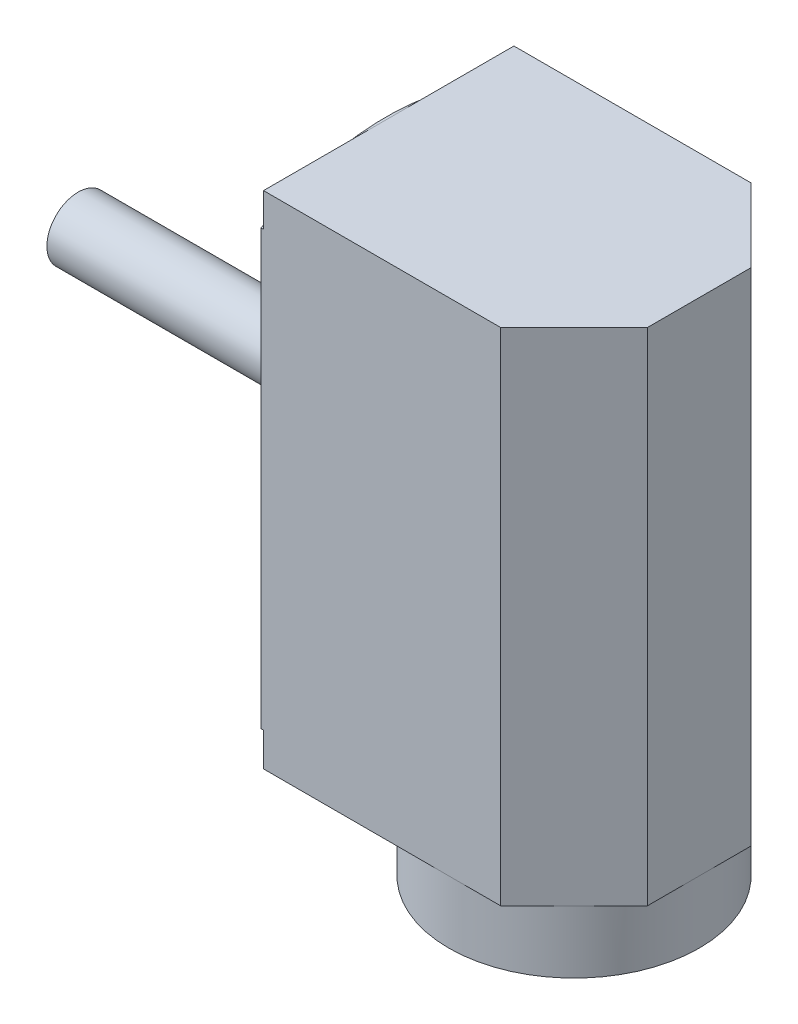
ISO-10303-21;
HEADER;
FILE_DESCRIPTION(('STEP AP214'),'2;1');
FILE_NAME('part.step','',(''),(''),'','','');
FILE_SCHEMA(('AUTOMOTIVE_DESIGN { 1 0 10303 214 1 1 1 1 }'));
ENDSEC;
DATA;
#1=APPLICATION_CONTEXT('core data for automotive mechanical design processes');
#2=APPLICATION_PROTOCOL_DEFINITION('international standard','automotive_design',2000,#1);
#3=PRODUCT_CONTEXT('',#1,'mechanical');
#4=PRODUCT('Part','Part','',(#3));
#5=PRODUCT_RELATED_PRODUCT_CATEGORY('part','',(#4));
#6=PRODUCT_DEFINITION_FORMATION('','',#4);
#7=PRODUCT_DEFINITION_CONTEXT('part definition',#1,'design');
#8=PRODUCT_DEFINITION('design','',#6,#7);
#9=PRODUCT_DEFINITION_SHAPE('','',#8);
#10=(LENGTH_UNIT() NAMED_UNIT(*) SI_UNIT(.MILLI.,.METRE.));
#11=(NAMED_UNIT(*) PLANE_ANGLE_UNIT() SI_UNIT($,.RADIAN.));
#12=(NAMED_UNIT(*) SI_UNIT($,.STERADIAN.) SOLID_ANGLE_UNIT());
#13=UNCERTAINTY_MEASURE_WITH_UNIT(LENGTH_MEASURE(1.E-05),#10,'distance_accuracy_value','');
#14=(GEOMETRIC_REPRESENTATION_CONTEXT(3) GLOBAL_UNCERTAINTY_ASSIGNED_CONTEXT((#13)) GLOBAL_UNIT_ASSIGNED_CONTEXT((#10,
#11,#12)) REPRESENTATION_CONTEXT('',''));
#15=CARTESIAN_POINT('',(0.,0.,0.));
#16=DIRECTION('',(0.,0.,1.));
#17=DIRECTION('',(1.,0.,0.));
#18=AXIS2_PLACEMENT_3D('',#15,#16,#17);
#19=CARTESIAN_POINT('',(0.,25.4,6.35));
#20=DIRECTION('',(1.,0.,0.));
#21=DIRECTION('',(0.,0.,-1.));
#22=AXIS2_PLACEMENT_3D('',#19,#20,#21);
#23=PLANE('',#22);
#24=CARTESIAN_POINT('',(0.,22.225,0.));
#25=DIRECTION('',(-1.,0.,0.));
#26=DIRECTION('',(0.,0.,1.));
#27=AXIS2_PLACEMENT_3D('',#24,#25,#26);
#28=CIRCLE('',#27,0.79375);
#29=CARTESIAN_POINT('',(0.,22.225,0.79375));
#30=VERTEX_POINT('',#29);
#31=EDGE_CURVE('E252',#30,#30,#28,.T.);
#32=ORIENTED_EDGE('',*,*,#31,.F.);
#33=EDGE_LOOP('',(#32));
#34=FACE_BOUND('',#33,.T.);
#35=CARTESIAN_POINT('',(0.,12.7,0.));
#36=DIRECTION('',(-1.,0.,0.));
#37=DIRECTION('',(0.,0.,1.));
#38=AXIS2_PLACEMENT_3D('',#35,#36,#37);
#39=CIRCLE('',#38,5.55625);
#40=CARTESIAN_POINT('',(0.,12.7,5.55625));
#41=VERTEX_POINT('',#40);
#42=EDGE_CURVE('E236',#41,#41,#39,.T.);
#43=ORIENTED_EDGE('',*,*,#42,.F.);
#44=EDGE_LOOP('',(#43));
#45=FACE_BOUND('',#44,.T.);
#46=DIRECTION('',(0.,-1.,0.));
#47=VECTOR('',#46,1.);
#48=CARTESIAN_POINT('',(0.,25.4,6.35));
#49=LINE('',#48,#47);
#50=CARTESIAN_POINT('',(0.,23.6985226280624,6.35));
#51=VERTEX_POINT('',#50);
#52=CARTESIAN_POINT('',(0.,1.70147737193763,6.35));
#53=VERTEX_POINT('',#52);
#54=EDGE_CURVE('E163',#51,#53,#49,.T.);
#55=ORIENTED_EDGE('',*,*,#54,.F.);
#56=CARTESIAN_POINT('',(0.,12.7,0.));
#57=DIRECTION('',(-1.,0.,0.));
#58=DIRECTION('',(0.,0.,1.));
#59=AXIS2_PLACEMENT_3D('',#56,#57,#58);
#60=CIRCLE('',#59,12.7);
#61=CARTESIAN_POINT('',(0.,23.6985226280624,-6.35));
#62=VERTEX_POINT('',#61);
#63=EDGE_CURVE('E145',#51,#62,#60,.T.);
#64=ORIENTED_EDGE('',*,*,#63,.T.);
#65=DIRECTION('',(0.,-1.,0.));
#66=VECTOR('',#65,1.);
#67=CARTESIAN_POINT('',(0.,25.4,-6.35));
#68=LINE('',#67,#66);
#69=CARTESIAN_POINT('',(0.,1.70147737193763,-6.35));
#70=VERTEX_POINT('',#69);
#71=EDGE_CURVE('E173',#62,#70,#68,.T.);
#72=ORIENTED_EDGE('',*,*,#71,.T.);
#73=CARTESIAN_POINT('',(0.,12.7,0.));
#74=DIRECTION('',(-1.,0.,0.));
#75=DIRECTION('',(0.,0.,1.));
#76=AXIS2_PLACEMENT_3D('',#73,#74,#75);
#77=CIRCLE('',#76,12.7);
#78=EDGE_CURVE('E170',#70,#53,#77,.T.);
#79=ORIENTED_EDGE('',*,*,#78,.T.);
#80=EDGE_LOOP('',(#55,#64,#72,#79));
#81=FACE_BOUND('',#80,.T.);
#82=ADVANCED_FACE('F43',(#34,#45,#81),#23,.F.);
#83=CARTESIAN_POINT('',(12.1552561210692,25.4,6.35));
#84=DIRECTION('',(0.,0.,-1.));
#85=DIRECTION('',(-1.,0.,0.));
#86=AXIS2_PLACEMENT_3D('',#83,#84,#85);
#87=PLANE('',#86);
#88=DIRECTION('',(-1.,0.,0.));
#89=VECTOR('',#88,1.);
#90=CARTESIAN_POINT('',(0.127000000000001,23.6985226280624,6.35));
#91=LINE('',#90,#89);
#92=CARTESIAN_POINT('',(0.127000000000001,23.6985226280624,6.35));
#93=VERTEX_POINT('',#92);
#94=EDGE_CURVE('E148',#93,#51,#91,.T.);
#95=ORIENTED_EDGE('',*,*,#94,.T.);
#96=ORIENTED_EDGE('',*,*,#54,.T.);
#97=DIRECTION('',(-1.,0.,0.));
#98=VECTOR('',#97,1.);
#99=CARTESIAN_POINT('',(0.127000000000001,1.70147737193763,6.35));
#100=LINE('',#99,#98);
#101=CARTESIAN_POINT('',(0.127000000000001,1.70147737193763,6.35));
#102=VERTEX_POINT('',#101);
#103=EDGE_CURVE('E293',#102,#53,#100,.T.);
#104=ORIENTED_EDGE('',*,*,#103,.F.);
#105=DIRECTION('',(0.,1.,0.));
#106=VECTOR('',#105,1.);
#107=CARTESIAN_POINT('',(0.127000000000001,0.,6.35));
#108=LINE('',#107,#106);
#109=CARTESIAN_POINT('',(0.127000000000001,0.,6.35));
#110=VERTEX_POINT('',#109);
#111=EDGE_CURVE('E289',#110,#102,#108,.T.);
#112=ORIENTED_EDGE('',*,*,#111,.F.);
#113=DIRECTION('',(1.,0.,0.));
#114=VECTOR('',#113,1.);
#115=CARTESIAN_POINT('',(12.1552561210692,0.,6.35));
#116=LINE('',#115,#114);
#117=CARTESIAN_POINT('',(9.525,0.,6.35));
#118=VERTEX_POINT('',#117);
#119=EDGE_CURVE('E346',#110,#118,#116,.T.);
#120=ORIENTED_EDGE('',*,*,#119,.T.);
#121=CARTESIAN_POINT('',(12.1552561210692,0.,6.35));
#122=VERTEX_POINT('',#121);
#123=EDGE_CURVE('E225',#118,#122,#116,.T.);
#124=ORIENTED_EDGE('',*,*,#123,.T.);
#125=DIRECTION('',(0.,-1.,0.));
#126=VECTOR('',#125,1.);
#127=CARTESIAN_POINT('',(12.1552561210692,25.4,6.35));
#128=LINE('',#127,#126);
#129=CARTESIAN_POINT('',(12.1552561210692,25.4,6.35));
#130=VERTEX_POINT('',#129);
#131=EDGE_CURVE('E47',#130,#122,#128,.T.);
#132=ORIENTED_EDGE('',*,*,#131,.F.);
#133=DIRECTION('',(1.,0.,0.));
#134=VECTOR('',#133,1.);
#135=CARTESIAN_POINT('',(12.1552561210692,25.4,6.35));
#136=LINE('',#135,#134);
#137=CARTESIAN_POINT('',(0.127000000000001,25.4,6.35));
#138=VERTEX_POINT('',#137);
#139=EDGE_CURVE('E331',#138,#130,#136,.T.);
#140=ORIENTED_EDGE('',*,*,#139,.F.);
#141=DIRECTION('',(0.,1.,0.));
#142=VECTOR('',#141,1.);
#143=CARTESIAN_POINT('',(0.127000000000001,0.,6.35));
#144=LINE('',#143,#142);
#145=EDGE_CURVE('E165',#93,#138,#144,.T.);
#146=ORIENTED_EDGE('',*,*,#145,.F.);
#147=EDGE_LOOP('',(#95,#96,#104,#112,#120,#124,#132,#140,#146));
#148=FACE_BOUND('',#147,.T.);
#149=ADVANCED_FACE('F45',(#148),#87,.F.);
#150=CARTESIAN_POINT('',(0.,25.4,0.));
#151=DIRECTION('',(0.,-1.,0.));
#152=DIRECTION('',(0.,0.,-1.));
#153=AXIS2_PLACEMENT_3D('',#150,#151,#152);
#154=PLANE('',#153);
#155=DIRECTION('',(0.,0.,-1.));
#156=VECTOR('',#155,1.);
#157=CARTESIAN_POINT('',(0.127,25.4,0.));
#158=LINE('',#157,#156);
#159=CARTESIAN_POINT('',(0.127,25.4,0.));
#160=VERTEX_POINT('',#159);
#161=EDGE_CURVE('E167',#138,#160,#158,.T.);
#162=ORIENTED_EDGE('',*,*,#161,.F.);
#163=ORIENTED_EDGE('',*,*,#139,.T.);
#164=DIRECTION('',(0.707106781186546,0.,-0.707106781186549));
#165=VECTOR('',#164,1.);
#166=CARTESIAN_POINT('',(15.875,25.4,2.63025612106914));
#167=LINE('',#166,#165);
#168=CARTESIAN_POINT('',(15.875,25.4,2.63025612106914));
#169=VERTEX_POINT('',#168);
#170=EDGE_CURVE('E354',#130,#169,#167,.T.);
#171=ORIENTED_EDGE('',*,*,#170,.T.);
#172=DIRECTION('',(0.,0.,-1.));
#173=VECTOR('',#172,1.);
#174=CARTESIAN_POINT('',(15.875,25.4,-2.63025612106914));
#175=LINE('',#174,#173);
#176=CARTESIAN_POINT('',(15.875,25.4,-2.63025612106914));
#177=VERTEX_POINT('',#176);
#178=EDGE_CURVE('E351',#169,#177,#175,.T.);
#179=ORIENTED_EDGE('',*,*,#178,.T.);
#180=DIRECTION('',(-0.707106781186545,0.,-0.70710678118655));
#181=VECTOR('',#180,1.);
#182=CARTESIAN_POINT('',(12.1552561210692,25.4,-6.35));
#183=LINE('',#182,#181);
#184=CARTESIAN_POINT('',(12.1552561210692,25.4,-6.35));
#185=VERTEX_POINT('',#184);
#186=EDGE_CURVE('E181',#177,#185,#183,.T.);
#187=ORIENTED_EDGE('',*,*,#186,.T.);
#188=DIRECTION('',(-1.,0.,0.));
#189=VECTOR('',#188,1.);
#190=CARTESIAN_POINT('',(0.,25.4,-6.35));
#191=LINE('',#190,#189);
#192=CARTESIAN_POINT('',(0.126999999999999,25.4,-6.35));
#193=VERTEX_POINT('',#192);
#194=EDGE_CURVE('E174',#185,#193,#191,.T.);
#195=ORIENTED_EDGE('',*,*,#194,.T.);
#196=DIRECTION('',(0.,0.,-1.));
#197=VECTOR('',#196,1.);
#198=CARTESIAN_POINT('',(0.127,25.4,0.));
#199=LINE('',#198,#197);
#200=EDGE_CURVE('E279',#160,#193,#199,.T.);
#201=ORIENTED_EDGE('',*,*,#200,.F.);
#202=EDGE_LOOP('',(#162,#163,#171,#179,#187,#195,#201));
#203=FACE_BOUND('',#202,.T.);
#204=ADVANCED_FACE('F310',(#203),#154,.F.);
#205=CARTESIAN_POINT('',(0.,0.,0.));
#206=DIRECTION('',(0.,-1.,0.));
#207=DIRECTION('',(0.,0.,-1.));
#208=AXIS2_PLACEMENT_3D('',#205,#206,#207);
#209=PLANE('',#208);
#210=ORIENTED_EDGE('',*,*,#119,.F.);
#211=DIRECTION('',(0.,0.,1.));
#212=VECTOR('',#211,1.);
#213=CARTESIAN_POINT('',(0.127,0.,0.));
#214=LINE('',#213,#212);
#215=CARTESIAN_POINT('',(0.127,0.,0.));
#216=VERTEX_POINT('',#215);
#217=EDGE_CURVE('E286',#216,#110,#214,.T.);
#218=ORIENTED_EDGE('',*,*,#217,.F.);
#219=DIRECTION('',(0.,0.,1.));
#220=VECTOR('',#219,1.);
#221=CARTESIAN_POINT('',(0.127,0.,0.));
#222=LINE('',#221,#220);
#223=CARTESIAN_POINT('',(0.126999999999999,0.,-6.35));
#224=VERTEX_POINT('',#223);
#225=EDGE_CURVE('E262',#224,#216,#222,.T.);
#226=ORIENTED_EDGE('',*,*,#225,.F.);
#227=DIRECTION('',(-1.,0.,0.));
#228=VECTOR('',#227,1.);
#229=CARTESIAN_POINT('',(0.,0.,-6.35));
#230=LINE('',#229,#228);
#231=CARTESIAN_POINT('',(9.525,0.,-6.35));
#232=VERTEX_POINT('',#231);
#233=EDGE_CURVE('E326',#232,#224,#230,.T.);
#234=ORIENTED_EDGE('',*,*,#233,.F.);
#235=CARTESIAN_POINT('',(9.525,0.,0.));
#236=DIRECTION('',(0.,-1.,0.));
#237=DIRECTION('',(0.,0.,-1.));
#238=AXIS2_PLACEMENT_3D('',#235,#236,#237);
#239=CIRCLE('',#238,6.35);
#240=EDGE_CURVE('E203',#118,#232,#239,.T.);
#241=ORIENTED_EDGE('',*,*,#240,.F.);
#242=EDGE_LOOP('',(#210,#218,#226,#234,#241));
#243=FACE_BOUND('',#242,.T.);
#244=ADVANCED_FACE('F325',(#243),#209,.T.);
#245=CARTESIAN_POINT('',(0.,25.4,-6.35));
#246=DIRECTION('',(0.,0.,1.));
#247=DIRECTION('',(1.,0.,0.));
#248=AXIS2_PLACEMENT_3D('',#245,#246,#247);
#249=PLANE('',#248);
#250=DIRECTION('',(-1.,0.,0.));
#251=VECTOR('',#250,1.);
#252=CARTESIAN_POINT('',(0.126999999999999,23.6985226280624,-6.35));
#253=LINE('',#252,#251);
#254=CARTESIAN_POINT('',(0.126999999999999,23.6985226280624,-6.35));
#255=VERTEX_POINT('',#254);
#256=EDGE_CURVE('E150',#255,#62,#253,.T.);
#257=ORIENTED_EDGE('',*,*,#256,.F.);
#258=DIRECTION('',(0.,-1.,0.));
#259=VECTOR('',#258,1.);
#260=CARTESIAN_POINT('',(0.126999999999999,0.,-6.35));
#261=LINE('',#260,#259);
#262=EDGE_CURVE('E274',#193,#255,#261,.T.);
#263=ORIENTED_EDGE('',*,*,#262,.F.);
#264=ORIENTED_EDGE('',*,*,#194,.F.);
#265=DIRECTION('',(0.,-1.,0.));
#266=VECTOR('',#265,1.);
#267=CARTESIAN_POINT('',(12.1552561210692,25.4,-6.35));
#268=LINE('',#267,#266);
#269=CARTESIAN_POINT('',(12.1552561210692,0.,-6.35));
#270=VERTEX_POINT('',#269);
#271=EDGE_CURVE('E178',#185,#270,#268,.T.);
#272=ORIENTED_EDGE('',*,*,#271,.T.);
#273=EDGE_CURVE('E184',#270,#232,#230,.T.);
#274=ORIENTED_EDGE('',*,*,#273,.T.);
#275=ORIENTED_EDGE('',*,*,#233,.T.);
#276=DIRECTION('',(0.,-1.,0.));
#277=VECTOR('',#276,1.);
#278=CARTESIAN_POINT('',(0.126999999999999,0.,-6.35));
#279=LINE('',#278,#277);
#280=CARTESIAN_POINT('',(0.126999999999999,1.70147737193763,-6.35));
#281=VERTEX_POINT('',#280);
#282=EDGE_CURVE('E70',#281,#224,#279,.T.);
#283=ORIENTED_EDGE('',*,*,#282,.F.);
#284=DIRECTION('',(-1.,0.,0.));
#285=VECTOR('',#284,1.);
#286=CARTESIAN_POINT('',(0.126999999999999,1.70147737193763,-6.35));
#287=LINE('',#286,#285);
#288=EDGE_CURVE('E157',#281,#70,#287,.T.);
#289=ORIENTED_EDGE('',*,*,#288,.T.);
#290=ORIENTED_EDGE('',*,*,#71,.F.);
#291=EDGE_LOOP('',(#257,#263,#264,#272,#274,#275,#283,#289,#290));
#292=FACE_BOUND('',#291,.T.);
#293=ADVANCED_FACE('F315',(#292),#249,.F.);
#294=CARTESIAN_POINT('',(14.0151280605346,0.,-4.49012806053456));
#295=VERTEX_POINT('',#294);
#296=EDGE_CURVE('E55',#232,#295,#239,.T.);
#297=ORIENTED_EDGE('',*,*,#296,.F.);
#298=ORIENTED_EDGE('',*,*,#273,.F.);
#299=DIRECTION('',(-0.707106781186545,0.,-0.70710678118655));
#300=VECTOR('',#299,1.);
#301=CARTESIAN_POINT('',(12.1552561210692,0.,-6.35));
#302=LINE('',#301,#300);
#303=EDGE_CURVE('E333',#295,#270,#302,.T.);
#304=ORIENTED_EDGE('',*,*,#303,.F.);
#305=EDGE_LOOP('',(#297,#298,#304));
#306=FACE_BOUND('',#305,.T.);
#307=ADVANCED_FACE('F398',(#306),#209,.T.);
#308=CARTESIAN_POINT('',(15.875,0.,0.));
#309=VERTEX_POINT('',#308);
#310=EDGE_CURVE('E12',#295,#309,#239,.T.);
#311=ORIENTED_EDGE('',*,*,#310,.F.);
#312=CARTESIAN_POINT('',(15.875,0.,-2.63025612106914));
#313=VERTEX_POINT('',#312);
#314=EDGE_CURVE('E328',#313,#295,#302,.T.);
#315=ORIENTED_EDGE('',*,*,#314,.F.);
#316=DIRECTION('',(0.,0.,-1.));
#317=VECTOR('',#316,1.);
#318=CARTESIAN_POINT('',(15.875,0.,-2.63025612106914));
#319=LINE('',#318,#317);
#320=EDGE_CURVE('E341',#309,#313,#319,.T.);
#321=ORIENTED_EDGE('',*,*,#320,.F.);
#322=EDGE_LOOP('',(#311,#315,#321));
#323=FACE_BOUND('',#322,.T.);
#324=ADVANCED_FACE('F372',(#323),#209,.T.);
#325=CARTESIAN_POINT('',(14.0151280605346,0.,4.49012806053457));
#326=VERTEX_POINT('',#325);
#327=EDGE_CURVE('E53',#309,#326,#239,.T.);
#328=ORIENTED_EDGE('',*,*,#327,.F.);
#329=CARTESIAN_POINT('',(15.875,0.,2.63025612106914));
#330=VERTEX_POINT('',#329);
#331=EDGE_CURVE('E337',#330,#309,#319,.T.);
#332=ORIENTED_EDGE('',*,*,#331,.F.);
#333=DIRECTION('',(0.707106781186546,0.,-0.707106781186549));
#334=VECTOR('',#333,1.);
#335=CARTESIAN_POINT('',(15.875,0.,2.63025612106914));
#336=LINE('',#335,#334);
#337=EDGE_CURVE('E345',#326,#330,#336,.T.);
#338=ORIENTED_EDGE('',*,*,#337,.F.);
#339=EDGE_LOOP('',(#328,#332,#338));
#340=FACE_BOUND('',#339,.T.);
#341=ADVANCED_FACE('F370',(#340),#209,.T.);
#342=EDGE_CURVE('E210',#326,#118,#239,.T.);
#343=ORIENTED_EDGE('',*,*,#342,.F.);
#344=EDGE_CURVE('E342',#122,#326,#336,.T.);
#345=ORIENTED_EDGE('',*,*,#344,.F.);
#346=ORIENTED_EDGE('',*,*,#123,.F.);
#347=EDGE_LOOP('',(#343,#345,#346));
#348=FACE_BOUND('',#347,.T.);
#349=ADVANCED_FACE('F363',(#348),#209,.T.);
#350=CARTESIAN_POINT('',(15.875,25.4,2.63025612106914));
#351=DIRECTION('',(-0.707106781186549,0.,-0.707106781186546));
#352=DIRECTION('',(-0.707106781186546,0.,0.707106781186549));
#353=AXIS2_PLACEMENT_3D('',#350,#351,#352);
#354=PLANE('',#353);
#355=ORIENTED_EDGE('',*,*,#344,.T.);
#356=ORIENTED_EDGE('',*,*,#337,.T.);
#357=DIRECTION('',(0.,-1.,0.));
#358=VECTOR('',#357,1.);
#359=CARTESIAN_POINT('',(15.875,25.4,2.63025612106914));
#360=LINE('',#359,#358);
#361=EDGE_CURVE('E193',#169,#330,#360,.T.);
#362=ORIENTED_EDGE('',*,*,#361,.F.);
#363=ORIENTED_EDGE('',*,*,#170,.F.);
#364=ORIENTED_EDGE('',*,*,#131,.T.);
#365=EDGE_LOOP('',(#355,#356,#362,#363,#364));
#366=FACE_BOUND('',#365,.T.);
#367=ADVANCED_FACE('F357',(#366),#354,.F.);
#368=CARTESIAN_POINT('',(15.875,25.4,-2.63025612106914));
#369=DIRECTION('',(-1.,0.,0.));
#370=DIRECTION('',(0.,0.,1.));
#371=AXIS2_PLACEMENT_3D('',#368,#369,#370);
#372=PLANE('',#371);
#373=ORIENTED_EDGE('',*,*,#331,.T.);
#374=ORIENTED_EDGE('',*,*,#320,.T.);
#375=DIRECTION('',(0.,-1.,0.));
#376=VECTOR('',#375,1.);
#377=CARTESIAN_POINT('',(15.875,25.4,-2.63025612106914));
#378=LINE('',#377,#376);
#379=EDGE_CURVE('E190',#177,#313,#378,.T.);
#380=ORIENTED_EDGE('',*,*,#379,.F.);
#381=ORIENTED_EDGE('',*,*,#178,.F.);
#382=ORIENTED_EDGE('',*,*,#361,.T.);
#383=EDGE_LOOP('',(#373,#374,#380,#381,#382));
#384=FACE_BOUND('',#383,.T.);
#385=ADVANCED_FACE('F376',(#384),#372,.F.);
#386=CARTESIAN_POINT('',(12.1552561210692,25.4,-6.35));
#387=DIRECTION('',(-0.70710678118655,0.,0.707106781186545));
#388=DIRECTION('',(0.707106781186545,0.,0.70710678118655));
#389=AXIS2_PLACEMENT_3D('',#386,#387,#388);
#390=PLANE('',#389);
#391=ORIENTED_EDGE('',*,*,#314,.T.);
#392=ORIENTED_EDGE('',*,*,#303,.T.);
#393=ORIENTED_EDGE('',*,*,#271,.F.);
#394=ORIENTED_EDGE('',*,*,#186,.F.);
#395=ORIENTED_EDGE('',*,*,#379,.T.);
#396=EDGE_LOOP('',(#391,#392,#393,#394,#395));
#397=FACE_BOUND('',#396,.T.);
#398=ADVANCED_FACE('F378',(#397),#390,.F.);
#399=CARTESIAN_POINT('',(9.525,-3.175,0.));
#400=DIRECTION('',(0.,-1.,0.));
#401=DIRECTION('',(0.,0.,-1.));
#402=AXIS2_PLACEMENT_3D('',#399,#400,#401);
#403=PLANE('',#402);
#404=CARTESIAN_POINT('',(9.525,-3.175,0.));
#405=DIRECTION('',(0.,-1.,0.));
#406=DIRECTION('',(0.,0.,-1.));
#407=AXIS2_PLACEMENT_3D('',#404,#405,#406);
#408=CIRCLE('',#407,6.35);
#409=CARTESIAN_POINT('',(9.525,-3.175,-6.35));
#410=VERTEX_POINT('',#409);
#411=EDGE_CURVE('E219',#410,#410,#408,.T.);
#412=ORIENTED_EDGE('',*,*,#411,.T.);
#413=EDGE_LOOP('',(#412));
#414=FACE_BOUND('',#413,.T.);
#415=CARTESIAN_POINT('',(9.525,-3.175,0.));
#416=DIRECTION('',(0.,-1.,0.));
#417=DIRECTION('',(0.,0.,-1.));
#418=AXIS2_PLACEMENT_3D('',#415,#416,#417);
#419=CIRCLE('',#418,4.7625);
#420=CARTESIAN_POINT('',(9.525,-3.175,-4.7625));
#421=VERTEX_POINT('',#420);
#422=EDGE_CURVE('E220',#421,#421,#419,.T.);
#423=ORIENTED_EDGE('',*,*,#422,.F.);
#424=EDGE_LOOP('',(#423));
#425=FACE_BOUND('',#424,.T.);
#426=ADVANCED_FACE('F384',(#414,#425),#403,.T.);
#427=CARTESIAN_POINT('',(9.525,-3.175,0.));
#428=DIRECTION('',(0.,1.,0.));
#429=DIRECTION('',(0.,0.,1.));
#430=AXIS2_PLACEMENT_3D('',#427,#428,#429);
#431=CYLINDRICAL_SURFACE('',#430,6.35);
#432=ORIENTED_EDGE('',*,*,#411,.F.);
#433=EDGE_LOOP('',(#432));
#434=FACE_BOUND('',#433,.T.);
#435=ORIENTED_EDGE('',*,*,#296,.T.);
#436=ORIENTED_EDGE('',*,*,#310,.T.);
#437=ORIENTED_EDGE('',*,*,#327,.T.);
#438=ORIENTED_EDGE('',*,*,#342,.T.);
#439=ORIENTED_EDGE('',*,*,#240,.T.);
#440=EDGE_LOOP('',(#435,#436,#437,#438,#439));
#441=FACE_BOUND('',#440,.T.);
#442=ADVANCED_FACE('F366',(#434,#441),#431,.T.);
#443=CARTESIAN_POINT('',(9.525,-3.175,0.));
#444=DIRECTION('',(0.,1.,0.));
#445=DIRECTION('',(0.,0.,1.));
#446=AXIS2_PLACEMENT_3D('',#443,#444,#445);
#447=CYLINDRICAL_SURFACE('',#446,4.7625);
#448=ORIENTED_EDGE('',*,*,#422,.T.);
#449=EDGE_LOOP('',(#448));
#450=FACE_BOUND('',#449,.T.);
#451=CARTESIAN_POINT('',(9.525,23.01875,0.));
#452=DIRECTION('',(0.,-1.,0.));
#453=DIRECTION('',(0.,0.,-1.));
#454=AXIS2_PLACEMENT_3D('',#451,#452,#453);
#455=CIRCLE('',#454,4.7625);
#456=CARTESIAN_POINT('',(9.525,23.01875,-4.7625));
#457=VERTEX_POINT('',#456);
#458=EDGE_CURVE('E227',#457,#457,#455,.T.);
#459=ORIENTED_EDGE('',*,*,#458,.F.);
#460=EDGE_LOOP('',(#459));
#461=FACE_BOUND('',#460,.T.);
#462=ADVANCED_FACE('F448',(#450,#461),#447,.F.);
#463=CARTESIAN_POINT('',(9.525,23.01875,0.));
#464=DIRECTION('',(0.,-1.,0.));
#465=DIRECTION('',(0.,0.,-1.));
#466=AXIS2_PLACEMENT_3D('',#463,#464,#465);
#467=PLANE('',#466);
#468=ORIENTED_EDGE('',*,*,#458,.T.);
#469=EDGE_LOOP('',(#468));
#470=FACE_BOUND('',#469,.T.);
#471=ADVANCED_FACE('F459',(#470),#467,.T.);
#472=CARTESIAN_POINT('',(0.254,12.7,0.));
#473=DIRECTION('',(-1.,0.,0.));
#474=DIRECTION('',(0.,0.,1.));
#475=AXIS2_PLACEMENT_3D('',#472,#473,#474);
#476=CYLINDRICAL_SURFACE('',#475,5.55625);
#477=CARTESIAN_POINT('',(0.254,12.7,0.));
#478=DIRECTION('',(-1.,0.,0.));
#479=DIRECTION('',(0.,0.,1.));
#480=AXIS2_PLACEMENT_3D('',#477,#478,#479);
#481=CIRCLE('',#480,5.55625);
#482=CARTESIAN_POINT('',(0.254000000000001,12.7,5.55625));
#483=VERTEX_POINT('',#482);
#484=EDGE_CURVE('E233',#483,#483,#481,.T.);
#485=ORIENTED_EDGE('',*,*,#484,.F.);
#486=EDGE_LOOP('',(#485));
#487=FACE_BOUND('',#486,.T.);
#488=ORIENTED_EDGE('',*,*,#42,.T.);
#489=EDGE_LOOP('',(#488));
#490=FACE_BOUND('',#489,.T.);
#491=ADVANCED_FACE('F472',(#487,#490),#476,.F.);
#492=CARTESIAN_POINT('',(0.254,12.7,0.));
#493=DIRECTION('',(-1.,0.,0.));
#494=DIRECTION('',(0.,0.,1.));
#495=AXIS2_PLACEMENT_3D('',#492,#493,#494);
#496=PLANE('',#495);
#497=CARTESIAN_POINT('',(0.254,12.7,0.));
#498=DIRECTION('',(-1.,0.,0.));
#499=DIRECTION('',(0.,0.,1.));
#500=AXIS2_PLACEMENT_3D('',#497,#498,#499);
#501=CIRCLE('',#500,1.5875);
#502=CARTESIAN_POINT('',(0.254,12.7,1.5875));
#503=VERTEX_POINT('',#502);
#504=EDGE_CURVE('E244',#503,#503,#501,.T.);
#505=ORIENTED_EDGE('',*,*,#504,.F.);
#506=EDGE_LOOP('',(#505));
#507=FACE_BOUND('',#506,.T.);
#508=ORIENTED_EDGE('',*,*,#484,.T.);
#509=EDGE_LOOP('',(#508));
#510=FACE_BOUND('',#509,.T.);
#511=ADVANCED_FACE('F483',(#507,#510),#496,.T.);
#512=CARTESIAN_POINT('',(-15.621,12.7,0.));
#513=DIRECTION('',(1.,0.,0.));
#514=DIRECTION('',(0.,0.,-1.));
#515=AXIS2_PLACEMENT_3D('',#512,#513,#514);
#516=CYLINDRICAL_SURFACE('',#515,1.5875);
#517=CARTESIAN_POINT('',(-15.621,12.7,0.));
#518=DIRECTION('',(-1.,0.,0.));
#519=DIRECTION('',(0.,0.,1.));
#520=AXIS2_PLACEMENT_3D('',#517,#518,#519);
#521=CIRCLE('',#520,1.5875);
#522=CARTESIAN_POINT('',(-15.621,12.7,1.5875));
#523=VERTEX_POINT('',#522);
#524=EDGE_CURVE('E240',#523,#523,#521,.T.);
#525=ORIENTED_EDGE('',*,*,#524,.F.);
#526=EDGE_LOOP('',(#525));
#527=FACE_BOUND('',#526,.T.);
#528=ORIENTED_EDGE('',*,*,#504,.T.);
#529=EDGE_LOOP('',(#528));
#530=FACE_BOUND('',#529,.T.);
#531=ADVANCED_FACE('F494',(#527,#530),#516,.T.);
#532=CARTESIAN_POINT('',(-15.621,12.7,0.));
#533=DIRECTION('',(-1.,0.,0.));
#534=DIRECTION('',(0.,0.,1.));
#535=AXIS2_PLACEMENT_3D('',#532,#533,#534);
#536=PLANE('',#535);
#537=ORIENTED_EDGE('',*,*,#524,.T.);
#538=EDGE_LOOP('',(#537));
#539=FACE_BOUND('',#538,.T.);
#540=ADVANCED_FACE('F505',(#539),#536,.T.);
#541=CARTESIAN_POINT('',(4.572,22.225,0.));
#542=DIRECTION('',(-1.,0.,0.));
#543=DIRECTION('',(0.,0.,1.));
#544=AXIS2_PLACEMENT_3D('',#541,#542,#543);
#545=CYLINDRICAL_SURFACE('',#544,0.79375);
#546=CARTESIAN_POINT('',(4.572,22.225,0.));
#547=DIRECTION('',(-1.,0.,0.));
#548=DIRECTION('',(0.,0.,1.));
#549=AXIS2_PLACEMENT_3D('',#546,#547,#548);
#550=CIRCLE('',#549,0.79375);
#551=CARTESIAN_POINT('',(4.572,22.225,0.793749999999999));
#552=VERTEX_POINT('',#551);
#553=EDGE_CURVE('E248',#552,#552,#550,.T.);
#554=ORIENTED_EDGE('',*,*,#553,.F.);
#555=EDGE_LOOP('',(#554));
#556=FACE_BOUND('',#555,.T.);
#557=ORIENTED_EDGE('',*,*,#31,.T.);
#558=EDGE_LOOP('',(#557));
#559=FACE_BOUND('',#558,.T.);
#560=ADVANCED_FACE('F516',(#556,#559),#545,.F.);
#561=CARTESIAN_POINT('',(4.572,22.225,0.));
#562=DIRECTION('',(-1.,0.,0.));
#563=DIRECTION('',(0.,0.,1.));
#564=AXIS2_PLACEMENT_3D('',#561,#562,#563);
#565=PLANE('',#564);
#566=ORIENTED_EDGE('',*,*,#553,.T.);
#567=EDGE_LOOP('',(#566));
#568=FACE_BOUND('',#567,.T.);
#569=ADVANCED_FACE('F527',(#568),#565,.T.);
#570=CARTESIAN_POINT('',(0.127,12.7,0.));
#571=DIRECTION('',(-1.,0.,0.));
#572=DIRECTION('',(0.,0.,1.));
#573=AXIS2_PLACEMENT_3D('',#570,#571,#572);
#574=CYLINDRICAL_SURFACE('',#573,12.7);
#575=ORIENTED_EDGE('',*,*,#78,.F.);
#576=ORIENTED_EDGE('',*,*,#288,.F.);
#577=CARTESIAN_POINT('',(0.127,12.7,0.));
#578=DIRECTION('',(-1.,0.,0.));
#579=DIRECTION('',(0.,0.,1.));
#580=AXIS2_PLACEMENT_3D('',#577,#578,#579);
#581=CIRCLE('',#580,12.7);
#582=EDGE_CURVE('E265',#281,#216,#581,.T.);
#583=ORIENTED_EDGE('',*,*,#582,.T.);
#584=CARTESIAN_POINT('',(0.127,12.7,0.));
#585=DIRECTION('',(-1.,0.,0.));
#586=DIRECTION('',(0.,0.,1.));
#587=AXIS2_PLACEMENT_3D('',#584,#585,#586);
#588=CIRCLE('',#587,12.7);
#589=EDGE_CURVE('E168',#216,#102,#588,.T.);
#590=ORIENTED_EDGE('',*,*,#589,.T.);
#591=ORIENTED_EDGE('',*,*,#103,.T.);
#592=EDGE_LOOP('',(#575,#576,#583,#590,#591));
#593=FACE_BOUND('',#592,.T.);
#594=ADVANCED_FACE('F319',(#593),#574,.T.);
#595=CARTESIAN_POINT('',(0.127,0.,0.));
#596=DIRECTION('',(-1.,0.,0.));
#597=DIRECTION('',(0.,0.,1.));
#598=AXIS2_PLACEMENT_3D('',#595,#596,#597);
#599=PLANE('',#598);
#600=ORIENTED_EDGE('',*,*,#582,.F.);
#601=ORIENTED_EDGE('',*,*,#282,.T.);
#602=ORIENTED_EDGE('',*,*,#225,.T.);
#603=EDGE_LOOP('',(#600,#601,#602));
#604=FACE_BOUND('',#603,.T.);
#605=ADVANCED_FACE('F320',(#604),#599,.T.);
#606=CARTESIAN_POINT('',(0.127,12.7,0.));
#607=DIRECTION('',(-1.,0.,0.));
#608=DIRECTION('',(0.,0.,1.));
#609=AXIS2_PLACEMENT_3D('',#606,#607,#608);
#610=CYLINDRICAL_SURFACE('',#609,12.7);
#611=ORIENTED_EDGE('',*,*,#63,.F.);
#612=ORIENTED_EDGE('',*,*,#94,.F.);
#613=CARTESIAN_POINT('',(0.127,12.7,0.));
#614=DIRECTION('',(-1.,0.,0.));
#615=DIRECTION('',(0.,0.,1.));
#616=AXIS2_PLACEMENT_3D('',#613,#614,#615);
#617=CIRCLE('',#616,12.7);
#618=EDGE_CURVE('E62',#93,#160,#617,.T.);
#619=ORIENTED_EDGE('',*,*,#618,.T.);
#620=CARTESIAN_POINT('',(0.127,12.7,0.));
#621=DIRECTION('',(-1.,0.,0.));
#622=DIRECTION('',(0.,0.,1.));
#623=AXIS2_PLACEMENT_3D('',#620,#621,#622);
#624=CIRCLE('',#623,12.7);
#625=EDGE_CURVE('E156',#160,#255,#624,.T.);
#626=ORIENTED_EDGE('',*,*,#625,.T.);
#627=ORIENTED_EDGE('',*,*,#256,.T.);
#628=EDGE_LOOP('',(#611,#612,#619,#626,#627));
#629=FACE_BOUND('',#628,.T.);
#630=ADVANCED_FACE('F147',(#629),#610,.T.);
#631=CARTESIAN_POINT('',(0.127,0.,0.));
#632=DIRECTION('',(-1.,0.,0.));
#633=DIRECTION('',(0.,0.,1.));
#634=AXIS2_PLACEMENT_3D('',#631,#632,#633);
#635=PLANE('',#634);
#636=ORIENTED_EDGE('',*,*,#625,.F.);
#637=ORIENTED_EDGE('',*,*,#200,.T.);
#638=ORIENTED_EDGE('',*,*,#262,.T.);
#639=EDGE_LOOP('',(#636,#637,#638));
#640=FACE_BOUND('',#639,.T.);
#641=ADVANCED_FACE('F308',(#640),#635,.T.);
#642=CARTESIAN_POINT('',(0.127,0.,0.));
#643=DIRECTION('',(-1.,0.,0.));
#644=DIRECTION('',(0.,0.,1.));
#645=AXIS2_PLACEMENT_3D('',#642,#643,#644);
#646=PLANE('',#645);
#647=ORIENTED_EDGE('',*,*,#618,.F.);
#648=ORIENTED_EDGE('',*,*,#145,.T.);
#649=ORIENTED_EDGE('',*,*,#161,.T.);
#650=EDGE_LOOP('',(#647,#648,#649));
#651=FACE_BOUND('',#650,.T.);
#652=ADVANCED_FACE('F304',(#651),#646,.T.);
#653=CARTESIAN_POINT('',(0.127,0.,0.));
#654=DIRECTION('',(-1.,0.,0.));
#655=DIRECTION('',(0.,0.,1.));
#656=AXIS2_PLACEMENT_3D('',#653,#654,#655);
#657=PLANE('',#656);
#658=ORIENTED_EDGE('',*,*,#589,.F.);
#659=ORIENTED_EDGE('',*,*,#217,.T.);
#660=ORIENTED_EDGE('',*,*,#111,.T.);
#661=EDGE_LOOP('',(#658,#659,#660));
#662=FACE_BOUND('',#661,.T.);
#663=ADVANCED_FACE('F620',(#662),#657,.T.);
#664=CLOSED_SHELL('',(#82,#149,#204,#244,#293,#307,#324,#341,#349,#367,#385,#398,#426,#442,#462,
#471,#491,#511,#531,#540,#560,#569,#594,#605,#630,#641,#652,#663));
#665=MANIFOLD_SOLID_BREP('B2',#664);
#666=ADVANCED_BREP_SHAPE_REPRESENTATION('',(#18,#665),#14);
#667=SHAPE_DEFINITION_REPRESENTATION(#9,#666);
ENDSEC;
END-ISO-10303-21;
